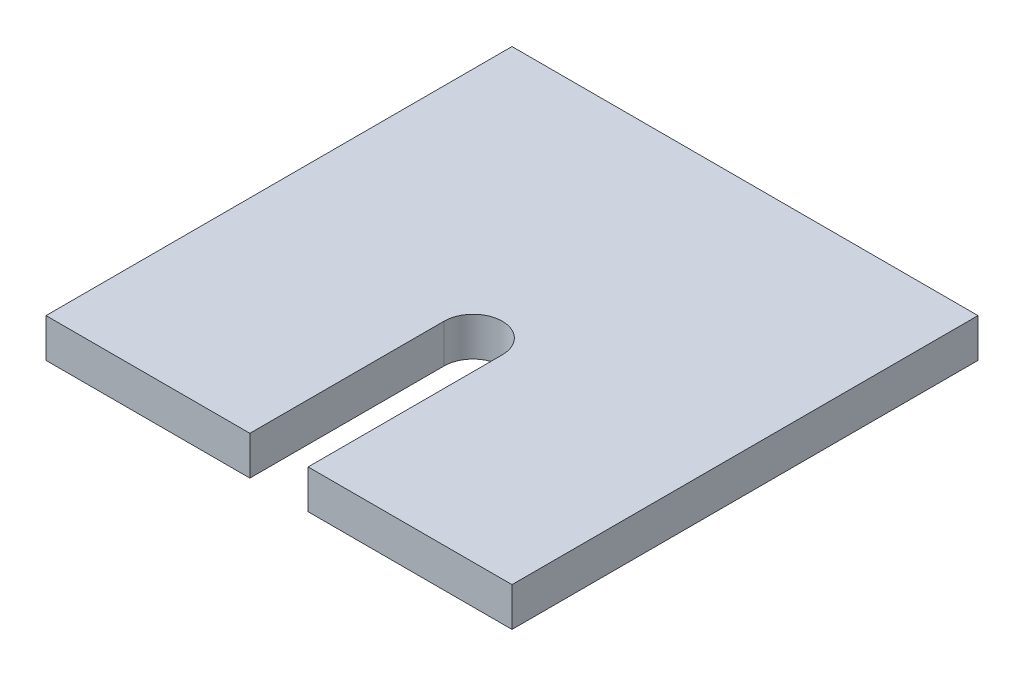
ISO-10303-21;
HEADER;
FILE_DESCRIPTION(('STEP AP214'),'2;1');
FILE_NAME('part.step','',(''),(''),'','','');
FILE_SCHEMA(('AUTOMOTIVE_DESIGN { 1 0 10303 214 1 1 1 1 }'));
ENDSEC;
DATA;
#1=APPLICATION_CONTEXT('core data for automotive mechanical design processes');
#2=APPLICATION_PROTOCOL_DEFINITION('international standard','automotive_design',2000,#1);
#3=PRODUCT_CONTEXT('',#1,'mechanical');
#4=PRODUCT('Part','Part','',(#3));
#5=PRODUCT_RELATED_PRODUCT_CATEGORY('part','',(#4));
#6=PRODUCT_DEFINITION_FORMATION('','',#4);
#7=PRODUCT_DEFINITION_CONTEXT('part definition',#1,'design');
#8=PRODUCT_DEFINITION('design','',#6,#7);
#9=PRODUCT_DEFINITION_SHAPE('','',#8);
#10=(LENGTH_UNIT() NAMED_UNIT(*) SI_UNIT(.MILLI.,.METRE.));
#11=(NAMED_UNIT(*) PLANE_ANGLE_UNIT() SI_UNIT($,.RADIAN.));
#12=(NAMED_UNIT(*) SI_UNIT($,.STERADIAN.) SOLID_ANGLE_UNIT());
#13=UNCERTAINTY_MEASURE_WITH_UNIT(LENGTH_MEASURE(1.E-05),#10,'distance_accuracy_value','');
#14=(GEOMETRIC_REPRESENTATION_CONTEXT(3) GLOBAL_UNCERTAINTY_ASSIGNED_CONTEXT((#13)) GLOBAL_UNIT_ASSIGNED_CONTEXT((#10,
#11,#12)) REPRESENTATION_CONTEXT('',''));
#15=CARTESIAN_POINT('',(0.,0.,0.));
#16=DIRECTION('',(0.,0.,1.));
#17=DIRECTION('',(1.,0.,0.));
#18=AXIS2_PLACEMENT_3D('',#15,#16,#17);
#19=CARTESIAN_POINT('',(-73.1719886676281,6.35,-28.4453100869769));
#20=DIRECTION('',(0.,0.,-1.));
#21=DIRECTION('',(-1.,0.,0.));
#22=AXIS2_PLACEMENT_3D('',#19,#20,#21);
#23=PLANE('',#22);
#24=DIRECTION('',(1.,0.,0.));
#25=VECTOR('',#24,1.);
#26=CARTESIAN_POINT('',(-73.1719886676281,0.,-28.4453100869769));
#27=LINE('',#26,#25);
#28=CARTESIAN_POINT('',(-73.1719886676281,0.,-28.4453100869769));
#29=VERTEX_POINT('',#28);
#30=CARTESIAN_POINT('',(3.02801133237194,0.,-28.4453100869769));
#31=VERTEX_POINT('',#30);
#32=EDGE_CURVE('E152',#29,#31,#27,.T.);
#33=ORIENTED_EDGE('',*,*,#32,.F.);
#34=DIRECTION('',(0.,-1.,0.));
#35=VECTOR('',#34,1.);
#36=CARTESIAN_POINT('',(-73.1719886676281,6.35,-28.4453100869769));
#37=LINE('',#36,#35);
#38=CARTESIAN_POINT('',(-73.1719886676281,6.35,-28.4453100869769));
#39=VERTEX_POINT('',#38);
#40=EDGE_CURVE('E11',#39,#29,#37,.T.);
#41=ORIENTED_EDGE('',*,*,#40,.F.);
#42=DIRECTION('',(1.,0.,0.));
#43=VECTOR('',#42,1.);
#44=CARTESIAN_POINT('',(-73.1719886676281,6.35,-28.4453100869769));
#45=LINE('',#44,#43);
#46=CARTESIAN_POINT('',(3.02801133237194,6.35,-28.4453100869769));
#47=VERTEX_POINT('',#46);
#48=EDGE_CURVE('E177',#39,#47,#45,.T.);
#49=ORIENTED_EDGE('',*,*,#48,.T.);
#50=DIRECTION('',(0.,-1.,0.));
#51=VECTOR('',#50,1.);
#52=CARTESIAN_POINT('',(3.02801133237194,6.35,-28.4453100869769));
#53=LINE('',#52,#51);
#54=EDGE_CURVE('E50',#47,#31,#53,.T.);
#55=ORIENTED_EDGE('',*,*,#54,.T.);
#56=EDGE_LOOP('',(#33,#41,#49,#55));
#57=FACE_BOUND('',#56,.T.);
#58=ADVANCED_FACE('F47',(#57),#23,.T.);
#59=CARTESIAN_POINT('',(-73.1719886676281,6.35,-28.4453100869769));
#60=DIRECTION('',(1.,0.,0.));
#61=DIRECTION('',(0.,0.,-1.));
#62=AXIS2_PLACEMENT_3D('',#59,#60,#61);
#63=PLANE('',#62);
#64=DIRECTION('',(0.,0.,1.));
#65=VECTOR('',#64,1.);
#66=CARTESIAN_POINT('',(-73.1719886676281,0.,-28.4453100869769));
#67=LINE('',#66,#65);
#68=CARTESIAN_POINT('',(-73.1719886676281,0.,47.7546899130231));
#69=VERTEX_POINT('',#68);
#70=EDGE_CURVE('E93',#29,#69,#67,.T.);
#71=ORIENTED_EDGE('',*,*,#70,.T.);
#72=DIRECTION('',(0.,-1.,0.));
#73=VECTOR('',#72,1.);
#74=CARTESIAN_POINT('',(-73.1719886676281,6.35,47.7546899130231));
#75=LINE('',#74,#73);
#76=CARTESIAN_POINT('',(-73.1719886676281,6.35,47.7546899130231));
#77=VERTEX_POINT('',#76);
#78=EDGE_CURVE('E57',#77,#69,#75,.T.);
#79=ORIENTED_EDGE('',*,*,#78,.F.);
#80=DIRECTION('',(0.,0.,1.));
#81=VECTOR('',#80,1.);
#82=CARTESIAN_POINT('',(-73.1719886676281,6.35,-28.4453100869769));
#83=LINE('',#82,#81);
#84=EDGE_CURVE('E126',#39,#77,#83,.T.);
#85=ORIENTED_EDGE('',*,*,#84,.F.);
#86=ORIENTED_EDGE('',*,*,#40,.T.);
#87=EDGE_LOOP('',(#71,#79,#85,#86));
#88=FACE_BOUND('',#87,.T.);
#89=ADVANCED_FACE('F225',(#88),#63,.F.);
#90=CARTESIAN_POINT('',(-73.1719886676281,6.35,47.7546899130231));
#91=DIRECTION('',(0.,0.,-1.));
#92=DIRECTION('',(-1.,0.,0.));
#93=AXIS2_PLACEMENT_3D('',#90,#91,#92);
#94=PLANE('',#93);
#95=DIRECTION('',(1.,0.,0.));
#96=VECTOR('',#95,1.);
#97=CARTESIAN_POINT('',(-73.1719886676281,0.,47.7546899130231));
#98=LINE('',#97,#96);
#99=CARTESIAN_POINT('',(-39.834488667628,0.,47.7546899130231));
#100=VERTEX_POINT('',#99);
#101=EDGE_CURVE('E134',#69,#100,#98,.T.);
#102=ORIENTED_EDGE('',*,*,#101,.T.);
#103=DIRECTION('',(0.,-1.,0.));
#104=VECTOR('',#103,1.);
#105=CARTESIAN_POINT('',(-39.834488667628,6.35,47.7546899130231));
#106=LINE('',#105,#104);
#107=CARTESIAN_POINT('',(-39.834488667628,6.35,47.7546899130231));
#108=VERTEX_POINT('',#107);
#109=EDGE_CURVE('E131',#108,#100,#106,.T.);
#110=ORIENTED_EDGE('',*,*,#109,.F.);
#111=DIRECTION('',(1.,0.,0.));
#112=VECTOR('',#111,1.);
#113=CARTESIAN_POINT('',(-73.1719886676281,6.35,47.7546899130231));
#114=LINE('',#113,#112);
#115=EDGE_CURVE('E118',#77,#108,#114,.T.);
#116=ORIENTED_EDGE('',*,*,#115,.F.);
#117=ORIENTED_EDGE('',*,*,#78,.T.);
#118=EDGE_LOOP('',(#102,#110,#116,#117));
#119=FACE_BOUND('',#118,.T.);
#120=ADVANCED_FACE('F132',(#119),#94,.F.);
#121=CARTESIAN_POINT('',(-39.8344886676281,6.35,16.0046899130231));
#122=DIRECTION('',(1.,0.,0.));
#123=DIRECTION('',(0.,0.,-1.));
#124=AXIS2_PLACEMENT_3D('',#121,#122,#123);
#125=PLANE('',#124);
#126=DIRECTION('',(0.,0.,1.));
#127=VECTOR('',#126,1.);
#128=CARTESIAN_POINT('',(-39.8344886676281,0.,16.0046899130231));
#129=LINE('',#128,#127);
#130=CARTESIAN_POINT('',(-39.8344886676281,0.,16.0046899130231));
#131=VERTEX_POINT('',#130);
#132=EDGE_CURVE('E171',#131,#100,#129,.T.);
#133=ORIENTED_EDGE('',*,*,#132,.F.);
#134=DIRECTION('',(0.,-1.,0.));
#135=VECTOR('',#134,1.);
#136=CARTESIAN_POINT('',(-39.8344886676281,6.35,16.0046899130231));
#137=LINE('',#136,#135);
#138=CARTESIAN_POINT('',(-39.8344886676281,6.35,16.0046899130231));
#139=VERTEX_POINT('',#138);
#140=EDGE_CURVE('E139',#139,#131,#137,.T.);
#141=ORIENTED_EDGE('',*,*,#140,.F.);
#142=DIRECTION('',(0.,0.,1.));
#143=VECTOR('',#142,1.);
#144=CARTESIAN_POINT('',(-39.8344886676281,6.35,16.0046899130231));
#145=LINE('',#144,#143);
#146=EDGE_CURVE('E124',#139,#108,#145,.T.);
#147=ORIENTED_EDGE('',*,*,#146,.T.);
#148=ORIENTED_EDGE('',*,*,#109,.T.);
#149=EDGE_LOOP('',(#133,#141,#147,#148));
#150=FACE_BOUND('',#149,.T.);
#151=ADVANCED_FACE('F141',(#150),#125,.T.);
#152=CARTESIAN_POINT('',(-35.0719886676281,6.35,16.0046899130231));
#153=DIRECTION('',(0.,-1.,0.));
#154=DIRECTION('',(0.,0.,-1.));
#155=AXIS2_PLACEMENT_3D('',#152,#153,#154);
#156=CYLINDRICAL_SURFACE('',#155,4.7625);
#157=CARTESIAN_POINT('',(-35.0719886676281,0.,16.0046899130231));
#158=DIRECTION('',(0.,1.,0.));
#159=DIRECTION('',(0.,0.,1.));
#160=AXIS2_PLACEMENT_3D('',#157,#158,#159);
#161=CIRCLE('',#160,4.7625);
#162=CARTESIAN_POINT('',(-30.3094886676281,0.,16.0046899130231));
#163=VERTEX_POINT('',#162);
#164=EDGE_CURVE('E167',#163,#131,#161,.T.);
#165=ORIENTED_EDGE('',*,*,#164,.F.);
#166=DIRECTION('',(0.,-1.,0.));
#167=VECTOR('',#166,1.);
#168=CARTESIAN_POINT('',(-30.3094886676281,6.35,16.0046899130231));
#169=LINE('',#168,#167);
#170=CARTESIAN_POINT('',(-30.3094886676281,6.35,16.0046899130231));
#171=VERTEX_POINT('',#170);
#172=EDGE_CURVE('E183',#171,#163,#169,.T.);
#173=ORIENTED_EDGE('',*,*,#172,.F.);
#174=CARTESIAN_POINT('',(-35.0719886676281,6.35,16.0046899130231));
#175=DIRECTION('',(0.,1.,0.));
#176=DIRECTION('',(0.,0.,1.));
#177=AXIS2_PLACEMENT_3D('',#174,#175,#176);
#178=CIRCLE('',#177,4.7625);
#179=EDGE_CURVE('E143',#171,#139,#178,.T.);
#180=ORIENTED_EDGE('',*,*,#179,.T.);
#181=ORIENTED_EDGE('',*,*,#140,.T.);
#182=EDGE_LOOP('',(#165,#173,#180,#181));
#183=FACE_BOUND('',#182,.T.);
#184=ADVANCED_FACE('F200',(#183),#156,.F.);
#185=CARTESIAN_POINT('',(-30.3094886676281,6.35,16.0046899130231));
#186=DIRECTION('',(1.,0.,0.));
#187=DIRECTION('',(0.,0.,-1.));
#188=AXIS2_PLACEMENT_3D('',#185,#186,#187);
#189=PLANE('',#188);
#190=DIRECTION('',(0.,0.,1.));
#191=VECTOR('',#190,1.);
#192=CARTESIAN_POINT('',(-30.3094886676281,0.,16.0046899130231));
#193=LINE('',#192,#191);
#194=CARTESIAN_POINT('',(-30.3094886676281,0.,47.7546899130231));
#195=VERTEX_POINT('',#194);
#196=EDGE_CURVE('E164',#163,#195,#193,.T.);
#197=ORIENTED_EDGE('',*,*,#196,.T.);
#198=DIRECTION('',(0.,-1.,0.));
#199=VECTOR('',#198,1.);
#200=CARTESIAN_POINT('',(-30.3094886676281,6.35,47.7546899130231));
#201=LINE('',#200,#199);
#202=CARTESIAN_POINT('',(-30.3094886676281,6.35,47.7546899130231));
#203=VERTEX_POINT('',#202);
#204=EDGE_CURVE('E186',#203,#195,#201,.T.);
#205=ORIENTED_EDGE('',*,*,#204,.F.);
#206=DIRECTION('',(0.,0.,1.));
#207=VECTOR('',#206,1.);
#208=CARTESIAN_POINT('',(-30.3094886676281,6.35,16.0046899130231));
#209=LINE('',#208,#207);
#210=EDGE_CURVE('E146',#171,#203,#209,.T.);
#211=ORIENTED_EDGE('',*,*,#210,.F.);
#212=ORIENTED_EDGE('',*,*,#172,.T.);
#213=EDGE_LOOP('',(#197,#205,#211,#212));
#214=FACE_BOUND('',#213,.T.);
#215=ADVANCED_FACE('F207',(#214),#189,.F.);
#216=CARTESIAN_POINT('',(-30.3094886676281,6.35,47.7546899130231));
#217=DIRECTION('',(0.,0.,-1.));
#218=DIRECTION('',(-1.,0.,0.));
#219=AXIS2_PLACEMENT_3D('',#216,#217,#218);
#220=PLANE('',#219);
#221=DIRECTION('',(1.,0.,0.));
#222=VECTOR('',#221,1.);
#223=CARTESIAN_POINT('',(-30.3094886676281,0.,47.7546899130231));
#224=LINE('',#223,#222);
#225=CARTESIAN_POINT('',(3.02801133237193,0.,47.7546899130231));
#226=VERTEX_POINT('',#225);
#227=EDGE_CURVE('E160',#195,#226,#224,.T.);
#228=ORIENTED_EDGE('',*,*,#227,.T.);
#229=DIRECTION('',(0.,-1.,0.));
#230=VECTOR('',#229,1.);
#231=CARTESIAN_POINT('',(3.02801133237193,6.35,47.7546899130231));
#232=LINE('',#231,#230);
#233=CARTESIAN_POINT('',(3.02801133237193,6.35,47.7546899130231));
#234=VERTEX_POINT('',#233);
#235=EDGE_CURVE('E189',#234,#226,#232,.T.);
#236=ORIENTED_EDGE('',*,*,#235,.F.);
#237=DIRECTION('',(1.,0.,0.));
#238=VECTOR('',#237,1.);
#239=CARTESIAN_POINT('',(-30.3094886676281,6.35,47.7546899130231));
#240=LINE('',#239,#238);
#241=EDGE_CURVE('E204',#203,#234,#240,.T.);
#242=ORIENTED_EDGE('',*,*,#241,.F.);
#243=ORIENTED_EDGE('',*,*,#204,.T.);
#244=EDGE_LOOP('',(#228,#236,#242,#243));
#245=FACE_BOUND('',#244,.T.);
#246=ADVANCED_FACE('F209',(#245),#220,.F.);
#247=CARTESIAN_POINT('',(3.02801133237194,6.35,-28.4453100869769));
#248=DIRECTION('',(1.,0.,0.));
#249=DIRECTION('',(0.,0.,-1.));
#250=AXIS2_PLACEMENT_3D('',#247,#248,#249);
#251=PLANE('',#250);
#252=DIRECTION('',(0.,0.,1.));
#253=VECTOR('',#252,1.);
#254=CARTESIAN_POINT('',(3.02801133237194,0.,-28.4453100869769));
#255=LINE('',#254,#253);
#256=EDGE_CURVE('E156',#31,#226,#255,.T.);
#257=ORIENTED_EDGE('',*,*,#256,.F.);
#258=ORIENTED_EDGE('',*,*,#54,.F.);
#259=DIRECTION('',(0.,0.,1.));
#260=VECTOR('',#259,1.);
#261=CARTESIAN_POINT('',(3.02801133237194,6.35,-28.4453100869769));
#262=LINE('',#261,#260);
#263=EDGE_CURVE('E211',#47,#234,#262,.T.);
#264=ORIENTED_EDGE('',*,*,#263,.T.);
#265=ORIENTED_EDGE('',*,*,#235,.T.);
#266=EDGE_LOOP('',(#257,#258,#264,#265));
#267=FACE_BOUND('',#266,.T.);
#268=ADVANCED_FACE('F193',(#267),#251,.T.);
#269=CARTESIAN_POINT('',(-35.0719886676281,6.35,16.0046899130231));
#270=DIRECTION('',(0.,1.,0.));
#271=DIRECTION('',(0.,0.,1.));
#272=AXIS2_PLACEMENT_3D('',#269,#270,#271);
#273=PLANE('',#272);
#274=ORIENTED_EDGE('',*,*,#48,.F.);
#275=ORIENTED_EDGE('',*,*,#84,.T.);
#276=ORIENTED_EDGE('',*,*,#115,.T.);
#277=ORIENTED_EDGE('',*,*,#146,.F.);
#278=ORIENTED_EDGE('',*,*,#179,.F.);
#279=ORIENTED_EDGE('',*,*,#210,.T.);
#280=ORIENTED_EDGE('',*,*,#241,.T.);
#281=ORIENTED_EDGE('',*,*,#263,.F.);
#282=EDGE_LOOP('',(#274,#275,#276,#277,#278,#279,#280,#281));
#283=FACE_BOUND('',#282,.T.);
#284=ADVANCED_FACE('F121',(#283),#273,.T.);
#285=CARTESIAN_POINT('',(-35.0719886676281,0.,16.0046899130231));
#286=DIRECTION('',(0.,1.,0.));
#287=DIRECTION('',(0.,0.,1.));
#288=AXIS2_PLACEMENT_3D('',#285,#286,#287);
#289=PLANE('',#288);
#290=ORIENTED_EDGE('',*,*,#32,.T.);
#291=ORIENTED_EDGE('',*,*,#256,.T.);
#292=ORIENTED_EDGE('',*,*,#227,.F.);
#293=ORIENTED_EDGE('',*,*,#196,.F.);
#294=ORIENTED_EDGE('',*,*,#164,.T.);
#295=ORIENTED_EDGE('',*,*,#132,.T.);
#296=ORIENTED_EDGE('',*,*,#101,.F.);
#297=ORIENTED_EDGE('',*,*,#70,.F.);
#298=EDGE_LOOP('',(#290,#291,#292,#293,#294,#295,#296,#297));
#299=FACE_BOUND('',#298,.T.);
#300=ADVANCED_FACE('F196',(#299),#289,.F.);
#301=CLOSED_SHELL('',(#58,#89,#120,#151,#184,#215,#246,#268,#284,#300));
#302=MANIFOLD_SOLID_BREP('B2',#301);
#303=ADVANCED_BREP_SHAPE_REPRESENTATION('',(#18,#302),#14);
#304=SHAPE_DEFINITION_REPRESENTATION(#9,#303);
ENDSEC;
END-ISO-10303-21;
